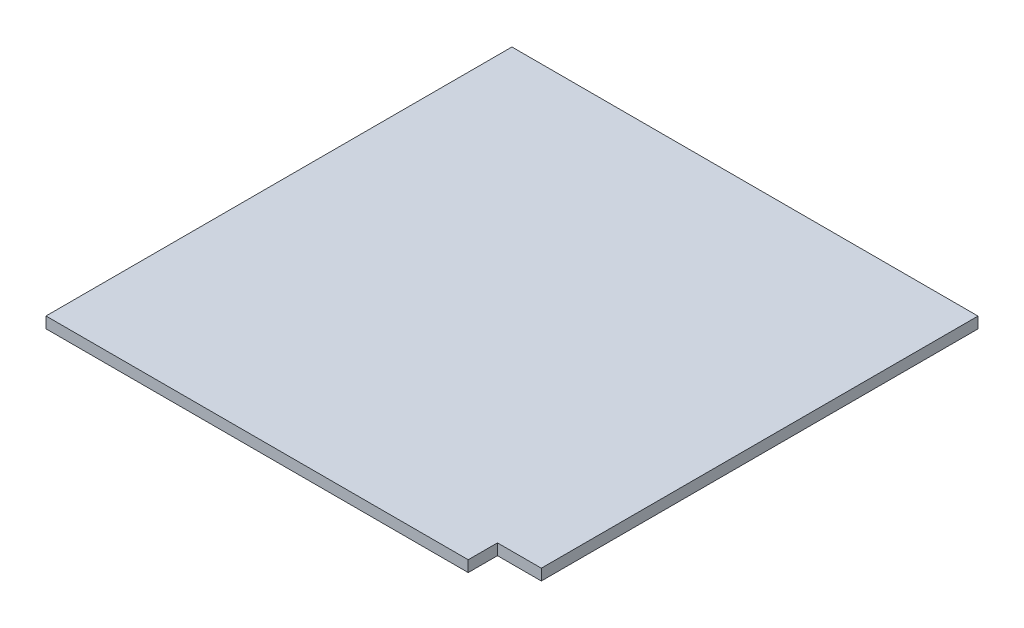
ISO-10303-21;
HEADER;
FILE_DESCRIPTION(('STEP AP214'),'2;1');
FILE_NAME('part.step','',(''),(''),'','','');
FILE_SCHEMA(('AUTOMOTIVE_DESIGN { 1 0 10303 214 1 1 1 1 }'));
ENDSEC;
DATA;
#1=APPLICATION_CONTEXT('core data for automotive mechanical design processes');
#2=APPLICATION_PROTOCOL_DEFINITION('international standard','automotive_design',2000,#1);
#3=PRODUCT_CONTEXT('',#1,'mechanical');
#4=PRODUCT('Part','Part','',(#3));
#5=PRODUCT_RELATED_PRODUCT_CATEGORY('part','',(#4));
#6=PRODUCT_DEFINITION_FORMATION('','',#4);
#7=PRODUCT_DEFINITION_CONTEXT('part definition',#1,'design');
#8=PRODUCT_DEFINITION('design','',#6,#7);
#9=PRODUCT_DEFINITION_SHAPE('','',#8);
#10=(LENGTH_UNIT() NAMED_UNIT(*) SI_UNIT(.MILLI.,.METRE.));
#11=(NAMED_UNIT(*) PLANE_ANGLE_UNIT() SI_UNIT($,.RADIAN.));
#12=(NAMED_UNIT(*) SI_UNIT($,.STERADIAN.) SOLID_ANGLE_UNIT());
#13=UNCERTAINTY_MEASURE_WITH_UNIT(LENGTH_MEASURE(1.E-05),#10,'distance_accuracy_value','');
#14=(GEOMETRIC_REPRESENTATION_CONTEXT(3) GLOBAL_UNCERTAINTY_ASSIGNED_CONTEXT((#13)) GLOBAL_UNIT_ASSIGNED_CONTEXT((#10,
#11,#12)) REPRESENTATION_CONTEXT('',''));
#15=CARTESIAN_POINT('',(0.,0.,0.));
#16=DIRECTION('',(0.,0.,1.));
#17=DIRECTION('',(1.,0.,0.));
#18=AXIS2_PLACEMENT_3D('',#15,#16,#17);
#19=CARTESIAN_POINT('',(88.815,2.286,0.));
#20=DIRECTION('',(0.,0.,-1.));
#21=DIRECTION('',(-1.,0.,0.));
#22=AXIS2_PLACEMENT_3D('',#19,#20,#21);
#23=PLANE('',#22);
#24=DIRECTION('',(1.,0.,0.));
#25=VECTOR('',#24,1.);
#26=CARTESIAN_POINT('',(88.815,0.,0.));
#27=LINE('',#26,#25);
#28=CARTESIAN_POINT('',(2.185,0.,0.));
#29=VERTEX_POINT('',#28);
#30=CARTESIAN_POINT('',(88.815,0.,0.));
#31=VERTEX_POINT('',#30);
#32=EDGE_CURVE('E117',#29,#31,#27,.T.);
#33=ORIENTED_EDGE('',*,*,#32,.T.);
#34=DIRECTION('',(0.,-1.,0.));
#35=VECTOR('',#34,1.);
#36=CARTESIAN_POINT('',(88.815,2.286,0.));
#37=LINE('',#36,#35);
#38=CARTESIAN_POINT('',(88.815,2.286,0.));
#39=VERTEX_POINT('',#38);
#40=EDGE_CURVE('E11',#39,#31,#37,.T.);
#41=ORIENTED_EDGE('',*,*,#40,.F.);
#42=DIRECTION('',(1.,0.,0.));
#43=VECTOR('',#42,1.);
#44=CARTESIAN_POINT('',(88.815,2.286,0.));
#45=LINE('',#44,#43);
#46=CARTESIAN_POINT('',(2.185,2.286,0.));
#47=VERTEX_POINT('',#46);
#48=EDGE_CURVE('E127',#47,#39,#45,.T.);
#49=ORIENTED_EDGE('',*,*,#48,.F.);
#50=DIRECTION('',(0.,-1.,0.));
#51=VECTOR('',#50,1.);
#52=CARTESIAN_POINT('',(2.185,2.286,0.));
#53=LINE('',#52,#51);
#54=EDGE_CURVE('E113',#47,#29,#53,.T.);
#55=ORIENTED_EDGE('',*,*,#54,.T.);
#56=EDGE_LOOP('',(#33,#41,#49,#55));
#57=FACE_BOUND('',#56,.T.);
#58=ADVANCED_FACE('F33',(#57),#23,.F.);
#59=CARTESIAN_POINT('',(88.815,2.286,0.));
#60=DIRECTION('',(-1.,0.,0.));
#61=DIRECTION('',(0.,0.,1.));
#62=AXIS2_PLACEMENT_3D('',#59,#60,#61);
#63=PLANE('',#62);
#64=DIRECTION('',(0.,0.,-1.));
#65=VECTOR('',#64,1.);
#66=CARTESIAN_POINT('',(88.815,0.,0.));
#67=LINE('',#66,#65);
#68=CARTESIAN_POINT('',(88.815,0.,-6.00000000000001));
#69=VERTEX_POINT('',#68);
#70=EDGE_CURVE('E120',#31,#69,#67,.T.);
#71=ORIENTED_EDGE('',*,*,#70,.T.);
#72=DIRECTION('',(0.,-1.,0.));
#73=VECTOR('',#72,1.);
#74=CARTESIAN_POINT('',(88.815,2.286,-6.00000000000001));
#75=LINE('',#74,#73);
#76=CARTESIAN_POINT('',(88.815,2.286,-6.00000000000001));
#77=VERTEX_POINT('',#76);
#78=EDGE_CURVE('E41',#77,#69,#75,.T.);
#79=ORIENTED_EDGE('',*,*,#78,.F.);
#80=DIRECTION('',(0.,0.,-1.));
#81=VECTOR('',#80,1.);
#82=CARTESIAN_POINT('',(88.815,2.286,0.));
#83=LINE('',#82,#81);
#84=EDGE_CURVE('E86',#39,#77,#83,.T.);
#85=ORIENTED_EDGE('',*,*,#84,.F.);
#86=ORIENTED_EDGE('',*,*,#40,.T.);
#87=EDGE_LOOP('',(#71,#79,#85,#86));
#88=FACE_BOUND('',#87,.T.);
#89=ADVANCED_FACE('F151',(#88),#63,.F.);
#90=CARTESIAN_POINT('',(88.815,2.286,-6.00000000000001));
#91=DIRECTION('',(0.,0.,-1.));
#92=DIRECTION('',(-1.,0.,0.));
#93=AXIS2_PLACEMENT_3D('',#90,#91,#92);
#94=PLANE('',#93);
#95=DIRECTION('',(1.,0.,0.));
#96=VECTOR('',#95,1.);
#97=CARTESIAN_POINT('',(88.815,0.,-6.00000000000001));
#98=LINE('',#97,#96);
#99=CARTESIAN_POINT('',(97.815,0.,-6.00000000000001));
#100=VERTEX_POINT('',#99);
#101=EDGE_CURVE('E122',#69,#100,#98,.T.);
#102=ORIENTED_EDGE('',*,*,#101,.T.);
#103=DIRECTION('',(0.,-1.,0.));
#104=VECTOR('',#103,1.);
#105=CARTESIAN_POINT('',(97.815,2.286,-6.00000000000001));
#106=LINE('',#105,#104);
#107=CARTESIAN_POINT('',(97.815,2.286,-6.00000000000001));
#108=VERTEX_POINT('',#107);
#109=EDGE_CURVE('E108',#108,#100,#106,.T.);
#110=ORIENTED_EDGE('',*,*,#109,.F.);
#111=DIRECTION('',(1.,0.,0.));
#112=VECTOR('',#111,1.);
#113=CARTESIAN_POINT('',(88.815,2.286,-6.00000000000001));
#114=LINE('',#113,#112);
#115=EDGE_CURVE('E99',#77,#108,#114,.T.);
#116=ORIENTED_EDGE('',*,*,#115,.F.);
#117=ORIENTED_EDGE('',*,*,#78,.T.);
#118=EDGE_LOOP('',(#102,#110,#116,#117));
#119=FACE_BOUND('',#118,.T.);
#120=ADVANCED_FACE('F133',(#119),#94,.F.);
#121=CARTESIAN_POINT('',(97.815,2.286,-6.00000000000001));
#122=DIRECTION('',(-1.,0.,0.));
#123=DIRECTION('',(0.,0.,1.));
#124=AXIS2_PLACEMENT_3D('',#121,#122,#123);
#125=PLANE('',#124);
#126=DIRECTION('',(0.,0.,-1.));
#127=VECTOR('',#126,1.);
#128=CARTESIAN_POINT('',(97.815,0.,-6.00000000000001));
#129=LINE('',#128,#127);
#130=CARTESIAN_POINT('',(97.815,0.,-95.6));
#131=VERTEX_POINT('',#130);
#132=EDGE_CURVE('E107',#100,#131,#129,.T.);
#133=ORIENTED_EDGE('',*,*,#132,.T.);
#134=DIRECTION('',(0.,-1.,0.));
#135=VECTOR('',#134,1.);
#136=CARTESIAN_POINT('',(97.815,2.286,-95.6));
#137=LINE('',#136,#135);
#138=CARTESIAN_POINT('',(97.815,2.286,-95.6));
#139=VERTEX_POINT('',#138);
#140=EDGE_CURVE('E104',#139,#131,#137,.T.);
#141=ORIENTED_EDGE('',*,*,#140,.F.);
#142=DIRECTION('',(0.,0.,-1.));
#143=VECTOR('',#142,1.);
#144=CARTESIAN_POINT('',(97.815,2.286,-6.00000000000001));
#145=LINE('',#144,#143);
#146=EDGE_CURVE('E93',#108,#139,#145,.T.);
#147=ORIENTED_EDGE('',*,*,#146,.F.);
#148=ORIENTED_EDGE('',*,*,#109,.T.);
#149=EDGE_LOOP('',(#133,#141,#147,#148));
#150=FACE_BOUND('',#149,.T.);
#151=ADVANCED_FACE('F105',(#150),#125,.F.);
#152=CARTESIAN_POINT('',(2.185,2.286,-95.6));
#153=DIRECTION('',(0.,0.,1.));
#154=DIRECTION('',(1.,0.,0.));
#155=AXIS2_PLACEMENT_3D('',#152,#153,#154);
#156=PLANE('',#155);
#157=DIRECTION('',(-1.,0.,0.));
#158=VECTOR('',#157,1.);
#159=CARTESIAN_POINT('',(2.185,0.,-95.6));
#160=LINE('',#159,#158);
#161=CARTESIAN_POINT('',(2.185,0.,-95.6));
#162=VERTEX_POINT('',#161);
#163=EDGE_CURVE('E72',#131,#162,#160,.T.);
#164=ORIENTED_EDGE('',*,*,#163,.T.);
#165=DIRECTION('',(0.,-1.,0.));
#166=VECTOR('',#165,1.);
#167=CARTESIAN_POINT('',(2.185,2.286,-95.6));
#168=LINE('',#167,#166);
#169=CARTESIAN_POINT('',(2.185,2.286,-95.6));
#170=VERTEX_POINT('',#169);
#171=EDGE_CURVE('E109',#170,#162,#168,.T.);
#172=ORIENTED_EDGE('',*,*,#171,.F.);
#173=DIRECTION('',(-1.,0.,0.));
#174=VECTOR('',#173,1.);
#175=CARTESIAN_POINT('',(2.185,2.286,-95.6));
#176=LINE('',#175,#174);
#177=EDGE_CURVE('E97',#139,#170,#176,.T.);
#178=ORIENTED_EDGE('',*,*,#177,.F.);
#179=ORIENTED_EDGE('',*,*,#140,.T.);
#180=EDGE_LOOP('',(#164,#172,#178,#179));
#181=FACE_BOUND('',#180,.T.);
#182=ADVANCED_FACE('F111',(#181),#156,.F.);
#183=CARTESIAN_POINT('',(2.185,2.286,0.));
#184=DIRECTION('',(1.,0.,0.));
#185=DIRECTION('',(0.,0.,-1.));
#186=AXIS2_PLACEMENT_3D('',#183,#184,#185);
#187=PLANE('',#186);
#188=DIRECTION('',(0.,0.,1.));
#189=VECTOR('',#188,1.);
#190=CARTESIAN_POINT('',(2.185,0.,0.));
#191=LINE('',#190,#189);
#192=EDGE_CURVE('E78',#162,#29,#191,.T.);
#193=ORIENTED_EDGE('',*,*,#192,.T.);
#194=ORIENTED_EDGE('',*,*,#54,.F.);
#195=DIRECTION('',(0.,0.,1.));
#196=VECTOR('',#195,1.);
#197=CARTESIAN_POINT('',(2.185,2.286,0.));
#198=LINE('',#197,#196);
#199=EDGE_CURVE('E49',#170,#47,#198,.T.);
#200=ORIENTED_EDGE('',*,*,#199,.F.);
#201=ORIENTED_EDGE('',*,*,#171,.T.);
#202=EDGE_LOOP('',(#193,#194,#200,#201));
#203=FACE_BOUND('',#202,.T.);
#204=ADVANCED_FACE('F140',(#203),#187,.F.);
#205=CARTESIAN_POINT('',(0.,2.286,0.));
#206=DIRECTION('',(0.,-1.,0.));
#207=DIRECTION('',(0.,0.,-1.));
#208=AXIS2_PLACEMENT_3D('',#205,#206,#207);
#209=PLANE('',#208);
#210=ORIENTED_EDGE('',*,*,#48,.T.);
#211=ORIENTED_EDGE('',*,*,#84,.T.);
#212=ORIENTED_EDGE('',*,*,#115,.T.);
#213=ORIENTED_EDGE('',*,*,#146,.T.);
#214=ORIENTED_EDGE('',*,*,#177,.T.);
#215=ORIENTED_EDGE('',*,*,#199,.T.);
#216=EDGE_LOOP('',(#210,#211,#212,#213,#214,#215));
#217=FACE_BOUND('',#216,.T.);
#218=ADVANCED_FACE('F95',(#217),#209,.F.);
#219=CARTESIAN_POINT('',(0.,0.,0.));
#220=DIRECTION('',(0.,-1.,0.));
#221=DIRECTION('',(0.,0.,-1.));
#222=AXIS2_PLACEMENT_3D('',#219,#220,#221);
#223=PLANE('',#222);
#224=ORIENTED_EDGE('',*,*,#32,.F.);
#225=ORIENTED_EDGE('',*,*,#192,.F.);
#226=ORIENTED_EDGE('',*,*,#163,.F.);
#227=ORIENTED_EDGE('',*,*,#132,.F.);
#228=ORIENTED_EDGE('',*,*,#101,.F.);
#229=ORIENTED_EDGE('',*,*,#70,.F.);
#230=EDGE_LOOP('',(#224,#225,#226,#227,#228,#229));
#231=FACE_BOUND('',#230,.T.);
#232=ADVANCED_FACE('F136',(#231),#223,.T.);
#233=CLOSED_SHELL('',(#58,#89,#120,#151,#182,#204,#218,#232));
#234=MANIFOLD_SOLID_BREP('B2',#233);
#235=ADVANCED_BREP_SHAPE_REPRESENTATION('',(#18,#234),#14);
#236=SHAPE_DEFINITION_REPRESENTATION(#9,#235);
ENDSEC;
END-ISO-10303-21;
